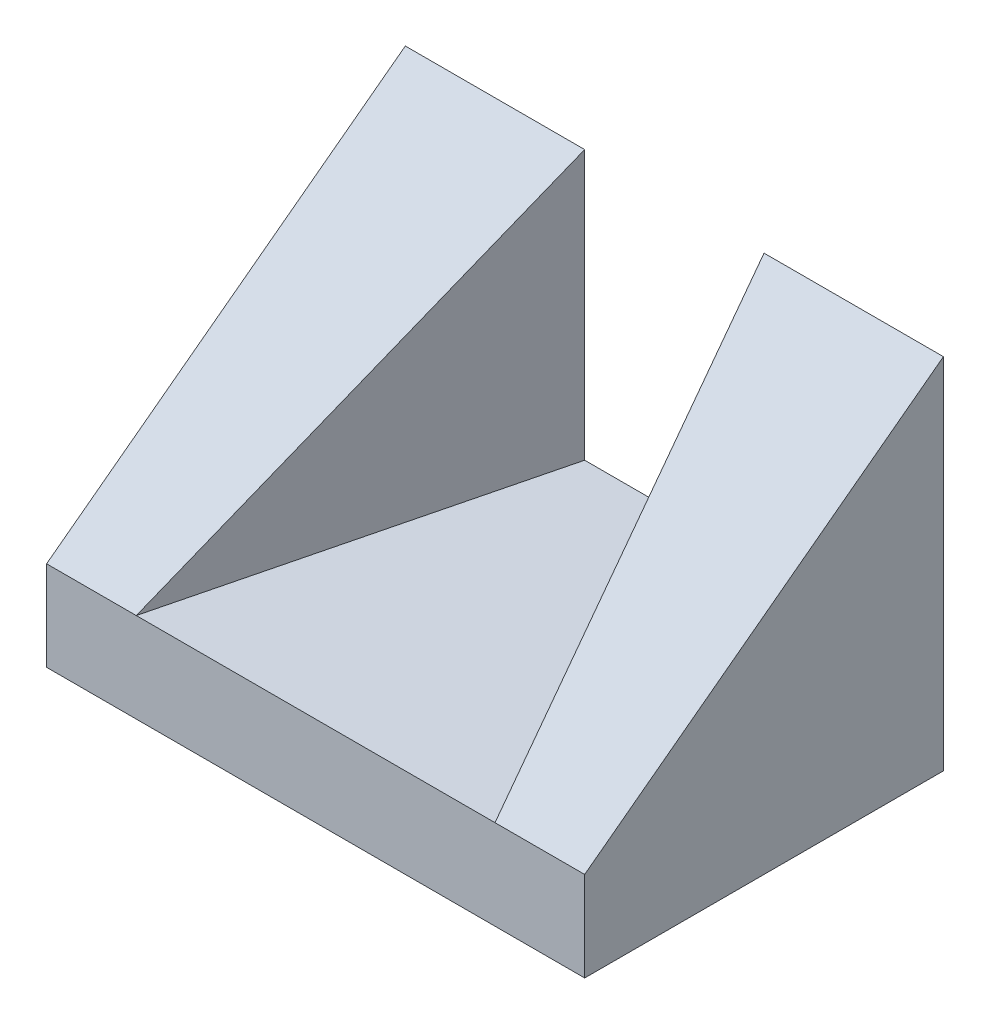
ISO-10303-21;
HEADER;
FILE_DESCRIPTION(('STEP AP214'),'2;1');
FILE_NAME('part.step','',(''),(''),'','','');
FILE_SCHEMA(('AUTOMOTIVE_DESIGN { 1 0 10303 214 1 1 1 1 }'));
ENDSEC;
DATA;
#1=APPLICATION_CONTEXT('core data for automotive mechanical design processes');
#2=APPLICATION_PROTOCOL_DEFINITION('international standard','automotive_design',2000,#1);
#3=PRODUCT_CONTEXT('',#1,'mechanical');
#4=PRODUCT('Part','Part','',(#3));
#5=PRODUCT_RELATED_PRODUCT_CATEGORY('part','',(#4));
#6=PRODUCT_DEFINITION_FORMATION('','',#4);
#7=PRODUCT_DEFINITION_CONTEXT('part definition',#1,'design');
#8=PRODUCT_DEFINITION('design','',#6,#7);
#9=PRODUCT_DEFINITION_SHAPE('','',#8);
#10=(LENGTH_UNIT() NAMED_UNIT(*) SI_UNIT(.MILLI.,.METRE.));
#11=(NAMED_UNIT(*) PLANE_ANGLE_UNIT() SI_UNIT($,.RADIAN.));
#12=(NAMED_UNIT(*) SI_UNIT($,.STERADIAN.) SOLID_ANGLE_UNIT());
#13=UNCERTAINTY_MEASURE_WITH_UNIT(LENGTH_MEASURE(1.E-05),#10,'distance_accuracy_value','');
#14=(GEOMETRIC_REPRESENTATION_CONTEXT(3) GLOBAL_UNCERTAINTY_ASSIGNED_CONTEXT((#13)) GLOBAL_UNIT_ASSIGNED_CONTEXT((#10,
#11,#12)) REPRESENTATION_CONTEXT('',''));
#15=CARTESIAN_POINT('',(0.,0.,0.));
#16=DIRECTION('',(0.,0.,1.));
#17=DIRECTION('',(1.,0.,0.));
#18=AXIS2_PLACEMENT_3D('',#15,#16,#17);
#19=CARTESIAN_POINT('',(0.,5.,0.));
#20=DIRECTION('',(0.,1.,0.));
#21=DIRECTION('',(0.,0.,1.));
#22=AXIS2_PLACEMENT_3D('',#19,#20,#21);
#23=PLANE('',#22);
#24=DIRECTION('',(1.,0.,0.));
#25=VECTOR('',#24,1.);
#26=CARTESIAN_POINT('',(0.,5.,10.));
#27=LINE('',#26,#25);
#28=CARTESIAN_POINT('',(-9.99999999999999,5.,10.));
#29=VERTEX_POINT('',#28);
#30=CARTESIAN_POINT('',(10.,5.,10.));
#31=VERTEX_POINT('',#30);
#32=EDGE_CURVE('E119',#29,#31,#27,.T.);
#33=ORIENTED_EDGE('',*,*,#32,.T.);
#34=DIRECTION('',(-0.242535625036333,0.,-0.970142500145332));
#35=VECTOR('',#34,1.);
#36=CARTESIAN_POINT('',(7.05882352941176,5.,-1.76470588235294));
#37=LINE('',#36,#35);
#38=CARTESIAN_POINT('',(5.,5.,-10.));
#39=VERTEX_POINT('',#38);
#40=EDGE_CURVE('E50',#31,#39,#37,.T.);
#41=ORIENTED_EDGE('',*,*,#40,.T.);
#42=DIRECTION('',(1.,0.,0.));
#43=VECTOR('',#42,1.);
#44=CARTESIAN_POINT('',(0.,5.,-10.));
#45=LINE('',#44,#43);
#46=CARTESIAN_POINT('',(-5.,5.,-10.));
#47=VERTEX_POINT('',#46);
#48=EDGE_CURVE('E124',#47,#39,#45,.T.);
#49=ORIENTED_EDGE('',*,*,#48,.F.);
#50=DIRECTION('',(0.242535625036333,0.,-0.970142500145332));
#51=VECTOR('',#50,1.);
#52=CARTESIAN_POINT('',(-7.05882352941176,5.,-1.76470588235294));
#53=LINE('',#52,#51);
#54=EDGE_CURVE('E129',#29,#47,#53,.T.);
#55=ORIENTED_EDGE('',*,*,#54,.F.);
#56=EDGE_LOOP('',(#33,#41,#49,#55));
#57=FACE_BOUND('',#56,.T.);
#58=ADVANCED_FACE('F35',(#57),#23,.T.);
#59=CARTESIAN_POINT('',(0.,5.,-10.));
#60=DIRECTION('',(0.,0.,-1.));
#61=DIRECTION('',(-1.,0.,0.));
#62=AXIS2_PLACEMENT_3D('',#59,#60,#61);
#63=PLANE('',#62);
#64=DIRECTION('',(0.,-1.,0.));
#65=VECTOR('',#64,1.);
#66=CARTESIAN_POINT('',(15.,5.,-10.));
#67=LINE('',#66,#65);
#68=CARTESIAN_POINT('',(15.,20.,-10.));
#69=VERTEX_POINT('',#68);
#70=CARTESIAN_POINT('',(15.,0.,-10.));
#71=VERTEX_POINT('',#70);
#72=EDGE_CURVE('E112',#69,#71,#67,.T.);
#73=ORIENTED_EDGE('',*,*,#72,.T.);
#74=DIRECTION('',(1.,0.,0.));
#75=VECTOR('',#74,1.);
#76=CARTESIAN_POINT('',(0.,0.,-10.));
#77=LINE('',#76,#75);
#78=CARTESIAN_POINT('',(-15.,0.,-10.));
#79=VERTEX_POINT('',#78);
#80=EDGE_CURVE('E58',#79,#71,#77,.T.);
#81=ORIENTED_EDGE('',*,*,#80,.F.);
#82=DIRECTION('',(0.,-1.,0.));
#83=VECTOR('',#82,1.);
#84=CARTESIAN_POINT('',(-15.,5.,-10.));
#85=LINE('',#84,#83);
#86=CARTESIAN_POINT('',(-15.,20.,-10.));
#87=VERTEX_POINT('',#86);
#88=EDGE_CURVE('E11',#87,#79,#85,.T.);
#89=ORIENTED_EDGE('',*,*,#88,.F.);
#90=DIRECTION('',(1.,0.,0.));
#91=VECTOR('',#90,1.);
#92=CARTESIAN_POINT('',(0.,20.,-10.));
#93=LINE('',#92,#91);
#94=CARTESIAN_POINT('',(-5.,20.,-10.));
#95=VERTEX_POINT('',#94);
#96=EDGE_CURVE('E137',#87,#95,#93,.T.);
#97=ORIENTED_EDGE('',*,*,#96,.T.);
#98=DIRECTION('',(0.,-1.,0.));
#99=VECTOR('',#98,1.);
#100=CARTESIAN_POINT('',(-5.,20.,-10.));
#101=LINE('',#100,#99);
#102=EDGE_CURVE('E134',#95,#47,#101,.T.);
#103=ORIENTED_EDGE('',*,*,#102,.T.);
#104=ORIENTED_EDGE('',*,*,#48,.T.);
#105=DIRECTION('',(0.,-1.,0.));
#106=VECTOR('',#105,1.);
#107=CARTESIAN_POINT('',(5.,20.,-10.));
#108=LINE('',#107,#106);
#109=CARTESIAN_POINT('',(5.,20.,-10.));
#110=VERTEX_POINT('',#109);
#111=EDGE_CURVE('E141',#110,#39,#108,.T.);
#112=ORIENTED_EDGE('',*,*,#111,.F.);
#113=DIRECTION('',(1.,0.,0.));
#114=VECTOR('',#113,1.);
#115=CARTESIAN_POINT('',(0.,20.,-10.));
#116=LINE('',#115,#114);
#117=EDGE_CURVE('E144',#110,#69,#116,.T.);
#118=ORIENTED_EDGE('',*,*,#117,.T.);
#119=EDGE_LOOP('',(#73,#81,#89,#97,#103,#104,#112,#118));
#120=FACE_BOUND('',#119,.T.);
#121=ADVANCED_FACE('F37',(#120),#63,.T.);
#122=CARTESIAN_POINT('',(-15.,5.,0.));
#123=DIRECTION('',(-1.,0.,0.));
#124=DIRECTION('',(0.,0.,1.));
#125=AXIS2_PLACEMENT_3D('',#122,#123,#124);
#126=PLANE('',#125);
#127=DIRECTION('',(0.,-0.6,0.8));
#128=VECTOR('',#127,1.);
#129=CARTESIAN_POINT('',(-15.,9.8,3.6));
#130=LINE('',#129,#128);
#131=CARTESIAN_POINT('',(-15.,5.,10.));
#132=VERTEX_POINT('',#131);
#133=EDGE_CURVE('E146',#87,#132,#130,.T.);
#134=ORIENTED_EDGE('',*,*,#133,.F.);
#135=ORIENTED_EDGE('',*,*,#88,.T.);
#136=DIRECTION('',(0.,0.,-1.));
#137=VECTOR('',#136,1.);
#138=CARTESIAN_POINT('',(-15.,0.,0.));
#139=LINE('',#138,#137);
#140=CARTESIAN_POINT('',(-15.,0.,10.));
#141=VERTEX_POINT('',#140);
#142=EDGE_CURVE('E126',#141,#79,#139,.T.);
#143=ORIENTED_EDGE('',*,*,#142,.F.);
#144=DIRECTION('',(0.,-1.,0.));
#145=VECTOR('',#144,1.);
#146=CARTESIAN_POINT('',(-15.,5.,10.));
#147=LINE('',#146,#145);
#148=EDGE_CURVE('E43',#132,#141,#147,.T.);
#149=ORIENTED_EDGE('',*,*,#148,.F.);
#150=EDGE_LOOP('',(#134,#135,#143,#149));
#151=FACE_BOUND('',#150,.T.);
#152=ADVANCED_FACE('F178',(#151),#126,.T.);
#153=CARTESIAN_POINT('',(0.,5.,10.));
#154=DIRECTION('',(0.,0.,-1.));
#155=DIRECTION('',(-1.,0.,0.));
#156=AXIS2_PLACEMENT_3D('',#153,#154,#155);
#157=PLANE('',#156);
#158=DIRECTION('',(0.,-1.,0.));
#159=VECTOR('',#158,1.);
#160=CARTESIAN_POINT('',(15.,5.,10.));
#161=LINE('',#160,#159);
#162=CARTESIAN_POINT('',(15.,5.,10.));
#163=VERTEX_POINT('',#162);
#164=CARTESIAN_POINT('',(15.,0.,10.));
#165=VERTEX_POINT('',#164);
#166=EDGE_CURVE('E110',#163,#165,#161,.T.);
#167=ORIENTED_EDGE('',*,*,#166,.F.);
#168=DIRECTION('',(1.,0.,0.));
#169=VECTOR('',#168,1.);
#170=CARTESIAN_POINT('',(-30.,5.,10.));
#171=LINE('',#170,#169);
#172=EDGE_CURVE('E95',#31,#163,#171,.T.);
#173=ORIENTED_EDGE('',*,*,#172,.F.);
#174=ORIENTED_EDGE('',*,*,#32,.F.);
#175=EDGE_CURVE('E105',#132,#29,#171,.T.);
#176=ORIENTED_EDGE('',*,*,#175,.F.);
#177=ORIENTED_EDGE('',*,*,#148,.T.);
#178=DIRECTION('',(1.,0.,0.));
#179=VECTOR('',#178,1.);
#180=CARTESIAN_POINT('',(0.,0.,10.));
#181=LINE('',#180,#179);
#182=EDGE_CURVE('E117',#141,#165,#181,.T.);
#183=ORIENTED_EDGE('',*,*,#182,.T.);
#184=EDGE_LOOP('',(#167,#173,#174,#176,#177,#183));
#185=FACE_BOUND('',#184,.T.);
#186=ADVANCED_FACE('F115',(#185),#157,.F.);
#187=CARTESIAN_POINT('',(15.,5.,0.));
#188=DIRECTION('',(-1.,0.,0.));
#189=DIRECTION('',(0.,0.,1.));
#190=AXIS2_PLACEMENT_3D('',#187,#188,#189);
#191=PLANE('',#190);
#192=ORIENTED_EDGE('',*,*,#72,.F.);
#193=DIRECTION('',(0.,0.6,-0.8));
#194=VECTOR('',#193,1.);
#195=CARTESIAN_POINT('',(15.,20.,-10.));
#196=LINE('',#195,#194);
#197=EDGE_CURVE('E98',#163,#69,#196,.T.);
#198=ORIENTED_EDGE('',*,*,#197,.F.);
#199=ORIENTED_EDGE('',*,*,#166,.T.);
#200=DIRECTION('',(0.,0.,-1.));
#201=VECTOR('',#200,1.);
#202=CARTESIAN_POINT('',(15.,0.,0.));
#203=LINE('',#202,#201);
#204=EDGE_CURVE('E122',#165,#71,#203,.T.);
#205=ORIENTED_EDGE('',*,*,#204,.T.);
#206=EDGE_LOOP('',(#192,#198,#199,#205));
#207=FACE_BOUND('',#206,.T.);
#208=ADVANCED_FACE('F108',(#207),#191,.F.);
#209=CARTESIAN_POINT('',(0.,0.,0.));
#210=DIRECTION('',(0.,1.,0.));
#211=DIRECTION('',(0.,0.,1.));
#212=AXIS2_PLACEMENT_3D('',#209,#210,#211);
#213=PLANE('',#212);
#214=ORIENTED_EDGE('',*,*,#204,.F.);
#215=ORIENTED_EDGE('',*,*,#182,.F.);
#216=ORIENTED_EDGE('',*,*,#142,.T.);
#217=ORIENTED_EDGE('',*,*,#80,.T.);
#218=EDGE_LOOP('',(#214,#215,#216,#217));
#219=FACE_BOUND('',#218,.T.);
#220=ADVANCED_FACE('F171',(#219),#213,.F.);
#221=CARTESIAN_POINT('',(-7.05882352941176,20.,-1.76470588235294));
#222=DIRECTION('',(0.970142500145332,0.,0.242535625036333));
#223=DIRECTION('',(0.242535625036333,0.,-0.970142500145332));
#224=AXIS2_PLACEMENT_3D('',#221,#222,#223);
#225=PLANE('',#224);
#226=DIRECTION('',(0.196116135138184,0.588348405414552,-0.784464540552736));
#227=VECTOR('',#226,1.);
#228=CARTESIAN_POINT('',(-6.34615384615384,15.9615384615385,-4.61538461538461));
#229=LINE('',#228,#227);
#230=EDGE_CURVE('E148',#29,#95,#229,.T.);
#231=ORIENTED_EDGE('',*,*,#230,.F.);
#232=ORIENTED_EDGE('',*,*,#54,.T.);
#233=ORIENTED_EDGE('',*,*,#102,.F.);
#234=EDGE_LOOP('',(#231,#232,#233));
#235=FACE_BOUND('',#234,.T.);
#236=ADVANCED_FACE('F161',(#235),#225,.T.);
#237=CARTESIAN_POINT('',(7.05882352941177,20.,-1.76470588235294));
#238=DIRECTION('',(0.970142500145332,0.,-0.242535625036333));
#239=DIRECTION('',(-0.242535625036333,0.,-0.970142500145332));
#240=AXIS2_PLACEMENT_3D('',#237,#238,#239);
#241=PLANE('',#240);
#242=ORIENTED_EDGE('',*,*,#40,.F.);
#243=DIRECTION('',(-0.196116135138184,0.588348405414552,-0.784464540552736));
#244=VECTOR('',#243,1.);
#245=CARTESIAN_POINT('',(6.34615384615385,15.9615384615385,-4.61538461538461));
#246=LINE('',#245,#244);
#247=EDGE_CURVE('E101',#31,#110,#246,.T.);
#248=ORIENTED_EDGE('',*,*,#247,.T.);
#249=ORIENTED_EDGE('',*,*,#111,.T.);
#250=EDGE_LOOP('',(#242,#248,#249));
#251=FACE_BOUND('',#250,.T.);
#252=ADVANCED_FACE('F163',(#251),#241,.F.);
#253=CARTESIAN_POINT('',(-30.,20.,-10.));
#254=DIRECTION('',(0.,-0.8,-0.6));
#255=DIRECTION('',(0.,0.6,-0.8));
#256=AXIS2_PLACEMENT_3D('',#253,#254,#255);
#257=PLANE('',#256);
#258=ORIENTED_EDGE('',*,*,#172,.T.);
#259=ORIENTED_EDGE('',*,*,#197,.T.);
#260=ORIENTED_EDGE('',*,*,#117,.F.);
#261=ORIENTED_EDGE('',*,*,#247,.F.);
#262=EDGE_LOOP('',(#258,#259,#260,#261));
#263=FACE_BOUND('',#262,.T.);
#264=ADVANCED_FACE('F97',(#263),#257,.F.);
#265=ORIENTED_EDGE('',*,*,#133,.T.);
#266=ORIENTED_EDGE('',*,*,#175,.T.);
#267=ORIENTED_EDGE('',*,*,#230,.T.);
#268=ORIENTED_EDGE('',*,*,#96,.F.);
#269=EDGE_LOOP('',(#265,#266,#267,#268));
#270=FACE_BOUND('',#269,.T.);
#271=ADVANCED_FACE('F155',(#270),#257,.F.);
#272=CLOSED_SHELL('',(#58,#121,#152,#186,#208,#220,#236,#252,#264,#271));
#273=MANIFOLD_SOLID_BREP('B2',#272);
#274=ADVANCED_BREP_SHAPE_REPRESENTATION('',(#18,#273),#14);
#275=SHAPE_DEFINITION_REPRESENTATION(#9,#274);
ENDSEC;
END-ISO-10303-21;
